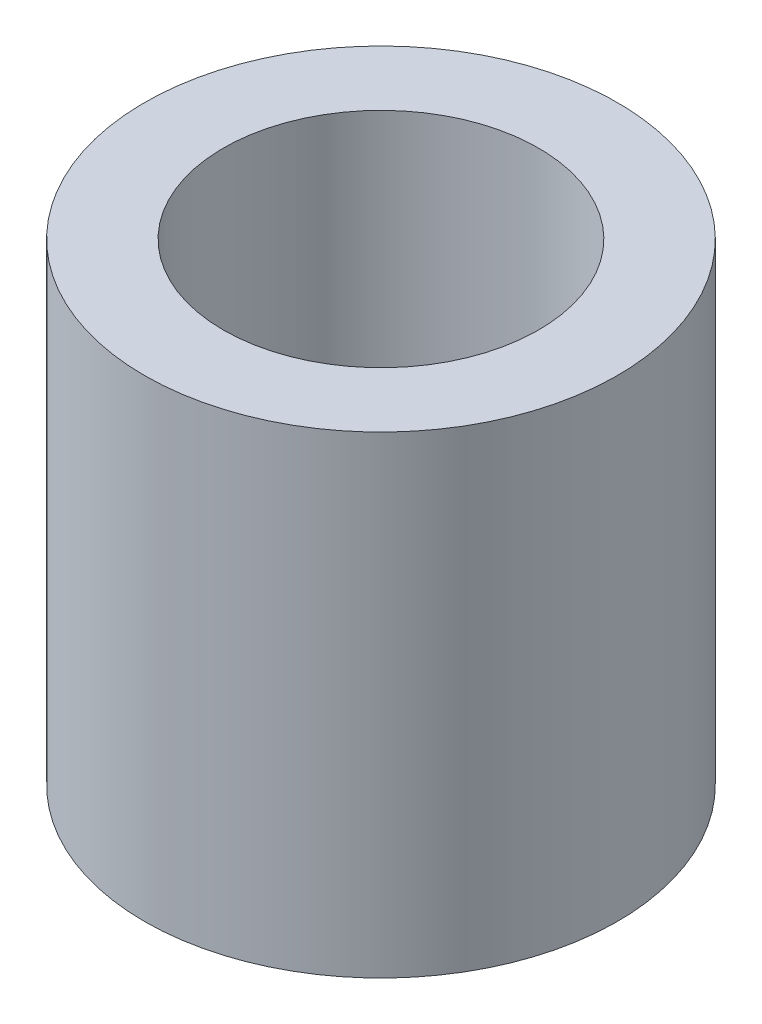
ISO-10303-21;
HEADER;
FILE_DESCRIPTION(('STEP AP214'),'2;1');
FILE_NAME('part.step','',(''),(''),'','','');
FILE_SCHEMA(('AUTOMOTIVE_DESIGN { 1 0 10303 214 1 1 1 1 }'));
ENDSEC;
DATA;
#1=APPLICATION_CONTEXT('core data for automotive mechanical design processes');
#2=APPLICATION_PROTOCOL_DEFINITION('international standard','automotive_design',2000,#1);
#3=PRODUCT_CONTEXT('',#1,'mechanical');
#4=PRODUCT('Part','Part','',(#3));
#5=PRODUCT_RELATED_PRODUCT_CATEGORY('part','',(#4));
#6=PRODUCT_DEFINITION_FORMATION('','',#4);
#7=PRODUCT_DEFINITION_CONTEXT('part definition',#1,'design');
#8=PRODUCT_DEFINITION('design','',#6,#7);
#9=PRODUCT_DEFINITION_SHAPE('','',#8);
#10=(LENGTH_UNIT() NAMED_UNIT(*) SI_UNIT(.MILLI.,.METRE.));
#11=(NAMED_UNIT(*) PLANE_ANGLE_UNIT() SI_UNIT($,.RADIAN.));
#12=(NAMED_UNIT(*) SI_UNIT($,.STERADIAN.) SOLID_ANGLE_UNIT());
#13=UNCERTAINTY_MEASURE_WITH_UNIT(LENGTH_MEASURE(1.E-05),#10,'distance_accuracy_value','');
#14=(GEOMETRIC_REPRESENTATION_CONTEXT(3) GLOBAL_UNCERTAINTY_ASSIGNED_CONTEXT((#13)) GLOBAL_UNIT_ASSIGNED_CONTEXT((#10,
#11,#12)) REPRESENTATION_CONTEXT('',''));
#15=CARTESIAN_POINT('',(0.,0.,0.));
#16=DIRECTION('',(0.,0.,1.));
#17=DIRECTION('',(1.,0.,0.));
#18=AXIS2_PLACEMENT_3D('',#15,#16,#17);
#19=CARTESIAN_POINT('',(0.,6.,0.));
#20=DIRECTION('',(0.,1.,0.));
#21=DIRECTION('',(0.,0.,1.));
#22=AXIS2_PLACEMENT_3D('',#19,#20,#21);
#23=PLANE('',#22);
#24=CARTESIAN_POINT('',(0.,6.,0.));
#25=DIRECTION('',(0.,1.,0.));
#26=DIRECTION('',(0.,0.,1.));
#27=AXIS2_PLACEMENT_3D('',#24,#25,#26);
#28=CIRCLE('',#27,3.);
#29=CARTESIAN_POINT('',(0.,6.,3.));
#30=VERTEX_POINT('',#29);
#31=EDGE_CURVE('E10',#30,#30,#28,.T.);
#32=ORIENTED_EDGE('',*,*,#31,.T.);
#33=EDGE_LOOP('',(#32));
#34=FACE_BOUND('',#33,.T.);
#35=CARTESIAN_POINT('',(0.,6.,0.));
#36=DIRECTION('',(0.,1.,0.));
#37=DIRECTION('',(0.,0.,1.));
#38=AXIS2_PLACEMENT_3D('',#35,#36,#37);
#39=CIRCLE('',#38,2.);
#40=CARTESIAN_POINT('',(0.,6.,2.));
#41=VERTEX_POINT('',#40);
#42=EDGE_CURVE('E42',#41,#41,#39,.T.);
#43=ORIENTED_EDGE('',*,*,#42,.F.);
#44=EDGE_LOOP('',(#43));
#45=FACE_BOUND('',#44,.T.);
#46=ADVANCED_FACE('F31',(#34,#45),#23,.T.);
#47=CARTESIAN_POINT('',(0.,0.,0.));
#48=DIRECTION('',(0.,1.,0.));
#49=DIRECTION('',(0.,0.,1.));
#50=AXIS2_PLACEMENT_3D('',#47,#48,#49);
#51=PLANE('',#50);
#52=CARTESIAN_POINT('',(0.,0.,0.));
#53=DIRECTION('',(0.,1.,0.));
#54=DIRECTION('',(0.,0.,1.));
#55=AXIS2_PLACEMENT_3D('',#52,#53,#54);
#56=CIRCLE('',#55,3.);
#57=CARTESIAN_POINT('',(0.,0.,3.));
#58=VERTEX_POINT('',#57);
#59=EDGE_CURVE('E35',#58,#58,#56,.T.);
#60=ORIENTED_EDGE('',*,*,#59,.F.);
#61=EDGE_LOOP('',(#60));
#62=FACE_BOUND('',#61,.T.);
#63=CARTESIAN_POINT('',(0.,0.,0.));
#64=DIRECTION('',(0.,1.,0.));
#65=DIRECTION('',(0.,0.,1.));
#66=AXIS2_PLACEMENT_3D('',#63,#64,#65);
#67=CIRCLE('',#66,2.);
#68=CARTESIAN_POINT('',(0.,0.,2.));
#69=VERTEX_POINT('',#68);
#70=EDGE_CURVE('E44',#69,#69,#67,.T.);
#71=ORIENTED_EDGE('',*,*,#70,.T.);
#72=EDGE_LOOP('',(#71));
#73=FACE_BOUND('',#72,.T.);
#74=ADVANCED_FACE('F54',(#62,#73),#51,.F.);
#75=CARTESIAN_POINT('',(0.,6.,0.));
#76=DIRECTION('',(0.,-1.,0.));
#77=DIRECTION('',(0.,0.,-1.));
#78=AXIS2_PLACEMENT_3D('',#75,#76,#77);
#79=CYLINDRICAL_SURFACE('',#78,3.);
#80=ORIENTED_EDGE('',*,*,#31,.F.);
#81=EDGE_LOOP('',(#80));
#82=FACE_BOUND('',#81,.T.);
#83=ORIENTED_EDGE('',*,*,#59,.T.);
#84=EDGE_LOOP('',(#83));
#85=FACE_BOUND('',#84,.T.);
#86=ADVANCED_FACE('F33',(#82,#85),#79,.T.);
#87=CARTESIAN_POINT('',(0.,6.,0.));
#88=DIRECTION('',(0.,-1.,0.));
#89=DIRECTION('',(0.,0.,-1.));
#90=AXIS2_PLACEMENT_3D('',#87,#88,#89);
#91=CYLINDRICAL_SURFACE('',#90,2.);
#92=ORIENTED_EDGE('',*,*,#42,.T.);
#93=EDGE_LOOP('',(#92));
#94=FACE_BOUND('',#93,.T.);
#95=ORIENTED_EDGE('',*,*,#70,.F.);
#96=EDGE_LOOP('',(#95));
#97=FACE_BOUND('',#96,.T.);
#98=ADVANCED_FACE('F50',(#94,#97),#91,.F.);
#99=CLOSED_SHELL('',(#46,#74,#86,#98));
#100=MANIFOLD_SOLID_BREP('B2',#99);
#101=ADVANCED_BREP_SHAPE_REPRESENTATION('',(#18,#100),#14);
#102=SHAPE_DEFINITION_REPRESENTATION(#9,#101);
ENDSEC;
END-ISO-10303-21;
